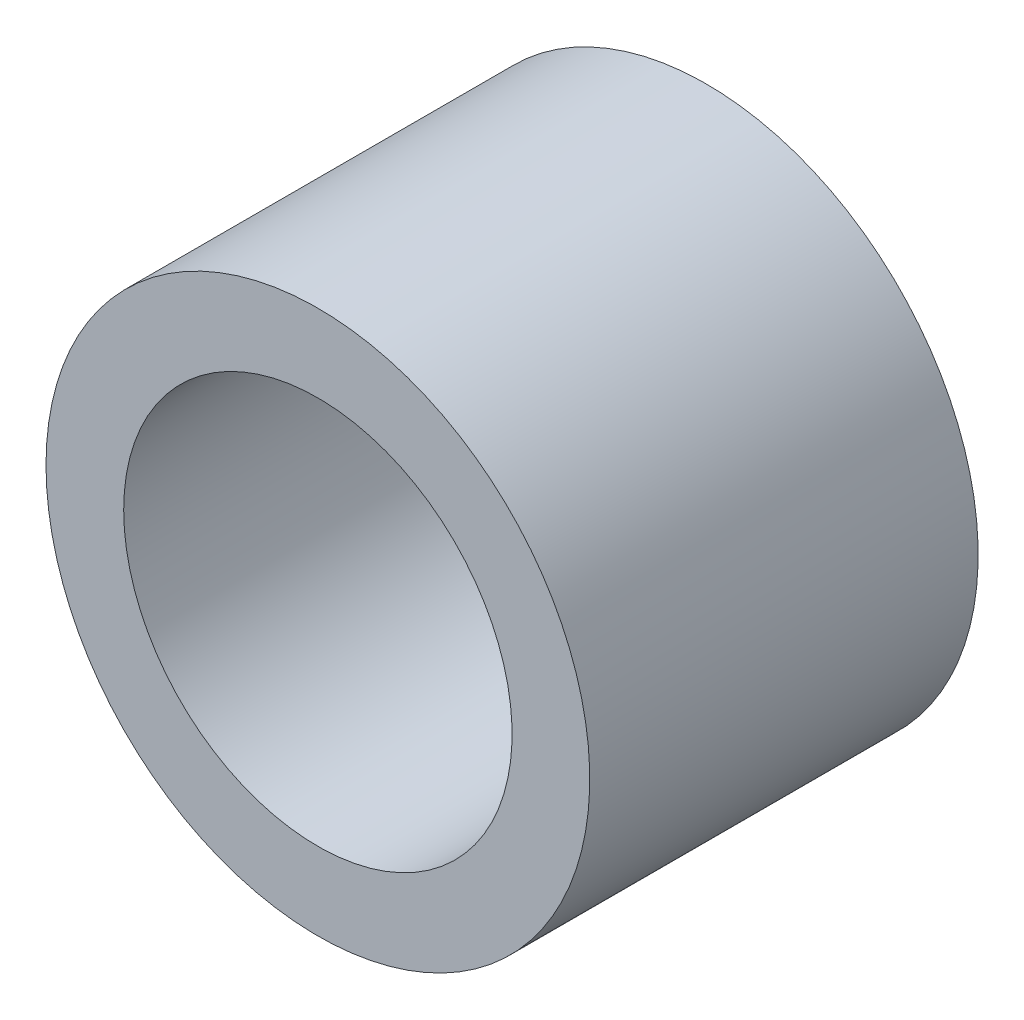
ISO-10303-21;
HEADER;
FILE_DESCRIPTION(('STEP AP214'),'2;1');
FILE_NAME('part.step','',(''),(''),'','','');
FILE_SCHEMA(('AUTOMOTIVE_DESIGN { 1 0 10303 214 1 1 1 1 }'));
ENDSEC;
DATA;
#1=APPLICATION_CONTEXT('core data for automotive mechanical design processes');
#2=APPLICATION_PROTOCOL_DEFINITION('international standard','automotive_design',2000,#1);
#3=PRODUCT_CONTEXT('',#1,'mechanical');
#4=PRODUCT('Part','Part','',(#3));
#5=PRODUCT_RELATED_PRODUCT_CATEGORY('part','',(#4));
#6=PRODUCT_DEFINITION_FORMATION('','',#4);
#7=PRODUCT_DEFINITION_CONTEXT('part definition',#1,'design');
#8=PRODUCT_DEFINITION('design','',#6,#7);
#9=PRODUCT_DEFINITION_SHAPE('','',#8);
#10=(LENGTH_UNIT() NAMED_UNIT(*) SI_UNIT(.MILLI.,.METRE.));
#11=(NAMED_UNIT(*) PLANE_ANGLE_UNIT() SI_UNIT($,.RADIAN.));
#12=(NAMED_UNIT(*) SI_UNIT($,.STERADIAN.) SOLID_ANGLE_UNIT());
#13=UNCERTAINTY_MEASURE_WITH_UNIT(LENGTH_MEASURE(1.E-05),#10,'distance_accuracy_value','');
#14=(GEOMETRIC_REPRESENTATION_CONTEXT(3) GLOBAL_UNCERTAINTY_ASSIGNED_CONTEXT((#13)) GLOBAL_UNIT_ASSIGNED_CONTEXT((#10,
#11,#12)) REPRESENTATION_CONTEXT('',''));
#15=CARTESIAN_POINT('',(0.,0.,0.));
#16=DIRECTION('',(0.,0.,1.));
#17=DIRECTION('',(1.,0.,0.));
#18=AXIS2_PLACEMENT_3D('',#15,#16,#17);
#19=CARTESIAN_POINT('',(0.,0.,-4.));
#20=DIRECTION('',(0.,0.,1.));
#21=DIRECTION('',(1.,0.,0.));
#22=AXIS2_PLACEMENT_3D('',#19,#20,#21);
#23=PLANE('',#22);
#24=CARTESIAN_POINT('',(0.,0.,-4.));
#25=DIRECTION('',(0.,0.,-1.));
#26=DIRECTION('',(-1.,0.,0.));
#27=AXIS2_PLACEMENT_3D('',#24,#25,#26);
#28=CIRCLE('',#27,2.);
#29=CARTESIAN_POINT('',(-2.,0.,-4.));
#30=VERTEX_POINT('',#29);
#31=EDGE_CURVE('E10',#30,#30,#28,.T.);
#32=ORIENTED_EDGE('',*,*,#31,.T.);
#33=EDGE_LOOP('',(#32));
#34=FACE_BOUND('',#33,.T.);
#35=ADVANCED_FACE('F38',(#34),#23,.F.);
#36=CARTESIAN_POINT('',(0.,0.,-12.6364766199357));
#37=DIRECTION('',(0.,0.,-1.));
#38=DIRECTION('',(-1.,0.,0.));
#39=AXIS2_PLACEMENT_3D('',#36,#37,#38);
#40=CYLINDRICAL_SURFACE('',#39,2.);
#41=ORIENTED_EDGE('',*,*,#31,.F.);
#42=EDGE_LOOP('',(#41));
#43=FACE_BOUND('',#42,.T.);
#44=CARTESIAN_POINT('',(0.,0.,-5.));
#45=DIRECTION('',(0.,0.,-1.));
#46=DIRECTION('',(-1.,0.,0.));
#47=AXIS2_PLACEMENT_3D('',#44,#45,#46);
#48=CIRCLE('',#47,2.);
#49=CARTESIAN_POINT('',(-2.,0.,-5.));
#50=VERTEX_POINT('',#49);
#51=EDGE_CURVE('E45',#50,#50,#48,.T.);
#52=ORIENTED_EDGE('',*,*,#51,.T.);
#53=EDGE_LOOP('',(#52));
#54=FACE_BOUND('',#53,.T.);
#55=ADVANCED_FACE('F82',(#43,#54),#40,.F.);
#56=CARTESIAN_POINT('',(2.,0.,-5.));
#57=DIRECTION('',(0.,0.,1.));
#58=DIRECTION('',(1.,0.,0.));
#59=AXIS2_PLACEMENT_3D('',#56,#57,#58);
#60=PLANE('',#59);
#61=ORIENTED_EDGE('',*,*,#51,.F.);
#62=EDGE_LOOP('',(#61));
#63=FACE_BOUND('',#62,.T.);
#64=CARTESIAN_POINT('',(0.,0.,-5.));
#65=DIRECTION('',(0.,0.,-1.));
#66=DIRECTION('',(-1.,0.,0.));
#67=AXIS2_PLACEMENT_3D('',#64,#65,#66);
#68=CIRCLE('',#67,7.);
#69=CARTESIAN_POINT('',(-7.,0.,-5.));
#70=VERTEX_POINT('',#69);
#71=EDGE_CURVE('E50',#70,#70,#68,.T.);
#72=ORIENTED_EDGE('',*,*,#71,.T.);
#73=EDGE_LOOP('',(#72));
#74=FACE_BOUND('',#73,.T.);
#75=ADVANCED_FACE('F86',(#63,#74),#60,.F.);
#76=CARTESIAN_POINT('',(0.,0.,-12.6364766199357));
#77=DIRECTION('',(0.,0.,-1.));
#78=DIRECTION('',(-1.,0.,0.));
#79=AXIS2_PLACEMENT_3D('',#76,#77,#78);
#80=CYLINDRICAL_SURFACE('',#79,7.);
#81=ORIENTED_EDGE('',*,*,#71,.F.);
#82=EDGE_LOOP('',(#81));
#83=FACE_BOUND('',#82,.T.);
#84=CARTESIAN_POINT('',(0.,0.,5.));
#85=DIRECTION('',(0.,0.,-1.));
#86=DIRECTION('',(-1.,0.,0.));
#87=AXIS2_PLACEMENT_3D('',#84,#85,#86);
#88=CIRCLE('',#87,7.);
#89=CARTESIAN_POINT('',(-7.,0.,5.));
#90=VERTEX_POINT('',#89);
#91=EDGE_CURVE('E55',#90,#90,#88,.T.);
#92=ORIENTED_EDGE('',*,*,#91,.T.);
#93=EDGE_LOOP('',(#92));
#94=FACE_BOUND('',#93,.T.);
#95=ADVANCED_FACE('F91',(#83,#94),#80,.T.);
#96=CARTESIAN_POINT('',(7.,0.,5.));
#97=DIRECTION('',(0.,0.,-1.));
#98=DIRECTION('',(-1.,0.,0.));
#99=AXIS2_PLACEMENT_3D('',#96,#97,#98);
#100=PLANE('',#99);
#101=ORIENTED_EDGE('',*,*,#91,.F.);
#102=EDGE_LOOP('',(#101));
#103=FACE_BOUND('',#102,.T.);
#104=CARTESIAN_POINT('',(0.,0.,5.));
#105=DIRECTION('',(0.,0.,-1.));
#106=DIRECTION('',(-1.,0.,0.));
#107=AXIS2_PLACEMENT_3D('',#104,#105,#106);
#108=CIRCLE('',#107,5.);
#109=CARTESIAN_POINT('',(-5.,0.,5.));
#110=VERTEX_POINT('',#109);
#111=EDGE_CURVE('E61',#110,#110,#108,.T.);
#112=ORIENTED_EDGE('',*,*,#111,.T.);
#113=EDGE_LOOP('',(#112));
#114=FACE_BOUND('',#113,.T.);
#115=ADVANCED_FACE('F78',(#103,#114),#100,.F.);
#116=CARTESIAN_POINT('',(0.,0.,-12.6364766199357));
#117=DIRECTION('',(0.,0.,-1.));
#118=DIRECTION('',(-1.,0.,0.));
#119=AXIS2_PLACEMENT_3D('',#116,#117,#118);
#120=CYLINDRICAL_SURFACE('',#119,5.);
#121=ORIENTED_EDGE('',*,*,#111,.F.);
#122=EDGE_LOOP('',(#121));
#123=FACE_BOUND('',#122,.T.);
#124=CARTESIAN_POINT('',(0.,0.,-3.));
#125=DIRECTION('',(0.,0.,-1.));
#126=DIRECTION('',(-1.,0.,0.));
#127=AXIS2_PLACEMENT_3D('',#124,#125,#126);
#128=CIRCLE('',#127,5.);
#129=CARTESIAN_POINT('',(-5.,0.,-3.));
#130=VERTEX_POINT('',#129);
#131=EDGE_CURVE('E65',#130,#130,#128,.T.);
#132=ORIENTED_EDGE('',*,*,#131,.T.);
#133=EDGE_LOOP('',(#132));
#134=FACE_BOUND('',#133,.T.);
#135=ADVANCED_FACE('F70',(#123,#134),#120,.F.);
#136=CARTESIAN_POINT('',(5.,0.,-3.));
#137=DIRECTION('',(0.,0.,-1.));
#138=DIRECTION('',(-1.,0.,0.));
#139=AXIS2_PLACEMENT_3D('',#136,#137,#138);
#140=PLANE('',#139);
#141=ORIENTED_EDGE('',*,*,#131,.F.);
#142=EDGE_LOOP('',(#141));
#143=FACE_BOUND('',#142,.T.);
#144=ADVANCED_FACE('F72',(#143),#140,.F.);
#145=CLOSED_SHELL('',(#35,#55,#75,#95,#115,#135,#144));
#146=MANIFOLD_SOLID_BREP('B2',#145);
#147=ADVANCED_BREP_SHAPE_REPRESENTATION('',(#18,#146),#14);
#148=SHAPE_DEFINITION_REPRESENTATION(#9,#147);
ENDSEC;
END-ISO-10303-21;
